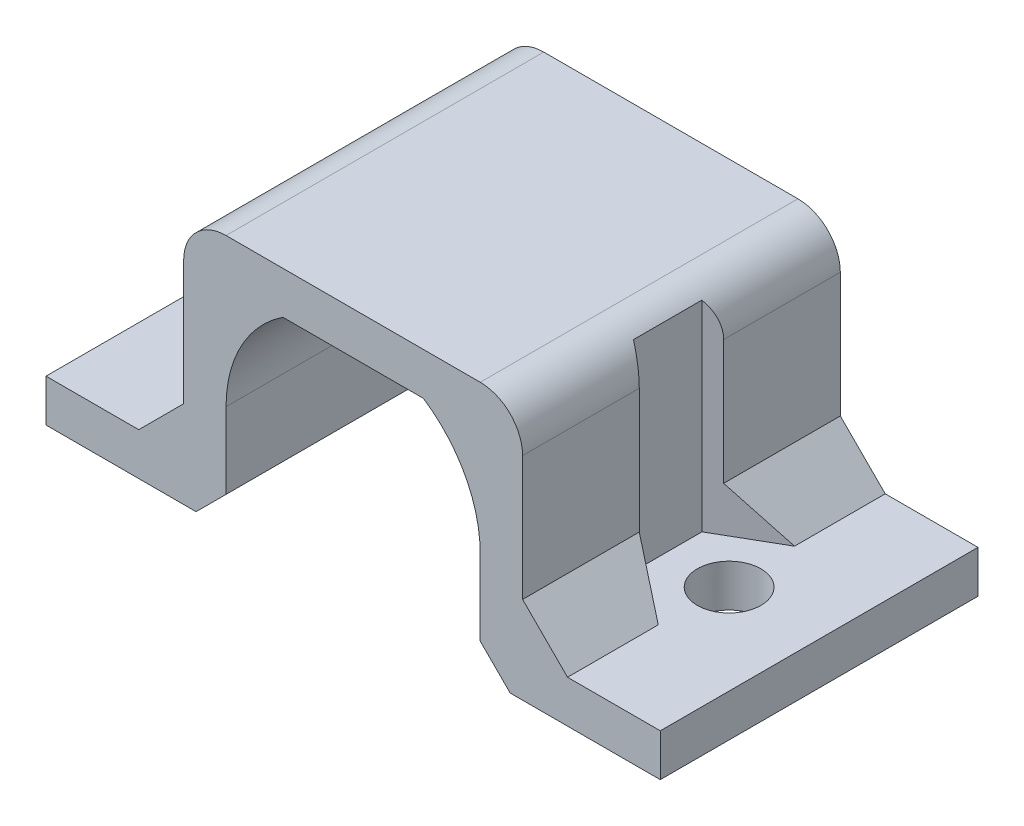
ISO-10303-21;
HEADER;
FILE_DESCRIPTION(('STEP AP214'),'2;1');
FILE_NAME('part.step','',(''),(''),'','','');
FILE_SCHEMA(('AUTOMOTIVE_DESIGN { 1 0 10303 214 1 1 1 1 }'));
ENDSEC;
DATA;
#1=APPLICATION_CONTEXT('core data for automotive mechanical design processes');
#2=APPLICATION_PROTOCOL_DEFINITION('international standard','automotive_design',2000,#1);
#3=PRODUCT_CONTEXT('',#1,'mechanical');
#4=PRODUCT('Part','Part','',(#3));
#5=PRODUCT_RELATED_PRODUCT_CATEGORY('part','',(#4));
#6=PRODUCT_DEFINITION_FORMATION('','',#4);
#7=PRODUCT_DEFINITION_CONTEXT('part definition',#1,'design');
#8=PRODUCT_DEFINITION('design','',#6,#7);
#9=PRODUCT_DEFINITION_SHAPE('','',#8);
#10=(LENGTH_UNIT() NAMED_UNIT(*) SI_UNIT(.MILLI.,.METRE.));
#11=(NAMED_UNIT(*) PLANE_ANGLE_UNIT() SI_UNIT($,.RADIAN.));
#12=(NAMED_UNIT(*) SI_UNIT($,.STERADIAN.) SOLID_ANGLE_UNIT());
#13=UNCERTAINTY_MEASURE_WITH_UNIT(LENGTH_MEASURE(1.E-05),#10,'distance_accuracy_value','');
#14=(GEOMETRIC_REPRESENTATION_CONTEXT(3) GLOBAL_UNCERTAINTY_ASSIGNED_CONTEXT((#13)) GLOBAL_UNIT_ASSIGNED_CONTEXT((#10,
#11,#12)) REPRESENTATION_CONTEXT('',''));
#15=CARTESIAN_POINT('',(0.,0.,0.));
#16=DIRECTION('',(0.,0.,1.));
#17=DIRECTION('',(1.,0.,0.));
#18=AXIS2_PLACEMENT_3D('',#15,#16,#17);
#19=CARTESIAN_POINT('',(7.99999999999999,4.12132034355965,7.5));
#20=DIRECTION('',(-0.707106781186549,-0.707106781186546,0.));
#21=DIRECTION('',(0.707106781186546,-0.707106781186549,0.));
#22=AXIS2_PLACEMENT_3D('',#19,#20,#21);
#23=PLANE('',#22);
#24=DIRECTION('',(0.,0.,-1.));
#25=VECTOR('',#24,1.);
#26=CARTESIAN_POINT('',(7.99999999999999,4.12132034355965,7.5));
#27=LINE('',#26,#25);
#28=CARTESIAN_POINT('',(7.99999999999999,4.12132034355965,-1.99185842870421));
#29=VERTEX_POINT('',#28);
#30=CARTESIAN_POINT('',(7.99999999999999,4.12132034355965,-7.5));
#31=VERTEX_POINT('',#30);
#32=EDGE_CURVE('E486',#29,#31,#27,.T.);
#33=ORIENTED_EDGE('',*,*,#32,.F.);
#34=DIRECTION('',(0.654653670707976,-0.654653670707979,-0.377964473009226));
#35=VECTOR('',#34,1.);
#36=CARTESIAN_POINT('',(5.65137413474764,6.46994620881202,-0.635878653175043));
#37=LINE('',#36,#35);
#38=CARTESIAN_POINT('',(10.1213203435596,2.00000000000005,-3.21660330009577));
#39=VERTEX_POINT('',#38);
#40=EDGE_CURVE('E277',#29,#39,#37,.T.);
#41=ORIENTED_EDGE('',*,*,#40,.T.);
#42=DIRECTION('',(0.,0.,-1.));
#43=VECTOR('',#42,1.);
#44=CARTESIAN_POINT('',(10.1213203435596,2.,7.5));
#45=LINE('',#44,#43);
#46=CARTESIAN_POINT('',(10.1213203435596,2.,-7.5));
#47=VERTEX_POINT('',#46);
#48=EDGE_CURVE('E491',#39,#47,#45,.T.);
#49=ORIENTED_EDGE('',*,*,#48,.T.);
#50=DIRECTION('',(-0.707106781186546,0.707106781186549,0.));
#51=VECTOR('',#50,1.);
#52=CARTESIAN_POINT('',(7.99999999999999,4.12132034355965,-7.5));
#53=LINE('',#52,#51);
#54=EDGE_CURVE('E381',#47,#31,#53,.T.);
#55=ORIENTED_EDGE('',*,*,#54,.T.);
#56=EDGE_LOOP('',(#33,#41,#49,#55));
#57=FACE_BOUND('',#56,.T.);
#58=ADVANCED_FACE('F39',(#57),#23,.F.);
#59=CARTESIAN_POINT('',(8.,12.,7.5));
#60=DIRECTION('',(-1.,0.,0.));
#61=DIRECTION('',(0.,-1.,0.));
#62=AXIS2_PLACEMENT_3D('',#59,#60,#61);
#63=PLANE('',#62);
#64=DIRECTION('',(0.,0.,-1.));
#65=VECTOR('',#64,1.);
#66=CARTESIAN_POINT('',(8.,10.,7.5));
#67=LINE('',#66,#65);
#68=CARTESIAN_POINT('',(8.,10.,-7.5));
#69=VERTEX_POINT('',#68);
#70=CARTESIAN_POINT('',(8.,10.,-1.99185842870421));
#71=VERTEX_POINT('',#70);
#72=EDGE_CURVE('E524',#69,#71,#67,.F.);
#73=ORIENTED_EDGE('',*,*,#72,.T.);
#74=DIRECTION('',(0.,-1.,0.));
#75=VECTOR('',#74,1.);
#76=CARTESIAN_POINT('',(8.,12.,-1.99185842870422));
#77=LINE('',#76,#75);
#78=EDGE_CURVE('E273',#71,#29,#77,.T.);
#79=ORIENTED_EDGE('',*,*,#78,.T.);
#80=ORIENTED_EDGE('',*,*,#32,.T.);
#81=DIRECTION('',(0.,1.,0.));
#82=VECTOR('',#81,1.);
#83=CARTESIAN_POINT('',(8.,12.,-7.5));
#84=LINE('',#83,#82);
#85=EDGE_CURVE('E385',#31,#69,#84,.T.);
#86=ORIENTED_EDGE('',*,*,#85,.T.);
#87=EDGE_LOOP('',(#73,#79,#80,#86));
#88=FACE_BOUND('',#87,.T.);
#89=ADVANCED_FACE('F614',(#88),#63,.F.);
#90=CARTESIAN_POINT('',(-8.,12.,7.5));
#91=DIRECTION('',(1.,0.,0.));
#92=DIRECTION('',(0.,1.,0.));
#93=AXIS2_PLACEMENT_3D('',#90,#91,#92);
#94=PLANE('',#93);
#95=DIRECTION('',(0.,0.,-1.));
#96=VECTOR('',#95,1.);
#97=CARTESIAN_POINT('',(-8.,10.,7.5));
#98=LINE('',#97,#96);
#99=CARTESIAN_POINT('',(-8.,10.,7.5));
#100=VERTEX_POINT('',#99);
#101=CARTESIAN_POINT('',(-8.,10.,1.99185842870421));
#102=VERTEX_POINT('',#101);
#103=EDGE_CURVE('E500',#100,#102,#98,.T.);
#104=ORIENTED_EDGE('',*,*,#103,.T.);
#105=DIRECTION('',(0.,-1.,0.));
#106=VECTOR('',#105,1.);
#107=CARTESIAN_POINT('',(-8.,12.,1.99185842870421));
#108=LINE('',#107,#106);
#109=CARTESIAN_POINT('',(-7.99999999999999,4.12132034355965,1.99185842870421));
#110=VERTEX_POINT('',#109);
#111=EDGE_CURVE('E306',#102,#110,#108,.T.);
#112=ORIENTED_EDGE('',*,*,#111,.T.);
#113=DIRECTION('',(0.,0.,-1.));
#114=VECTOR('',#113,1.);
#115=CARTESIAN_POINT('',(-7.99999999999999,4.12132034355965,7.5));
#116=LINE('',#115,#114);
#117=CARTESIAN_POINT('',(-7.99999999999999,4.12132034355965,7.5));
#118=VERTEX_POINT('',#117);
#119=EDGE_CURVE('E482',#118,#110,#116,.T.);
#120=ORIENTED_EDGE('',*,*,#119,.F.);
#121=DIRECTION('',(0.,-1.,0.));
#122=VECTOR('',#121,1.);
#123=CARTESIAN_POINT('',(-8.,12.,7.5));
#124=LINE('',#123,#122);
#125=EDGE_CURVE('E334',#100,#118,#124,.T.);
#126=ORIENTED_EDGE('',*,*,#125,.F.);
#127=EDGE_LOOP('',(#104,#112,#120,#126));
#128=FACE_BOUND('',#127,.T.);
#129=ADVANCED_FACE('F585',(#128),#94,.F.);
#130=CARTESIAN_POINT('',(-7.99999999999999,4.12132034355965,7.5));
#131=DIRECTION('',(0.707106781186549,-0.707106781186546,0.));
#132=DIRECTION('',(0.707106781186546,0.707106781186549,0.));
#133=AXIS2_PLACEMENT_3D('',#130,#131,#132);
#134=PLANE('',#133);
#135=ORIENTED_EDGE('',*,*,#119,.T.);
#136=DIRECTION('',(-0.654653670707976,-0.654653670707978,0.377964473009226));
#137=VECTOR('',#136,1.);
#138=CARTESIAN_POINT('',(-9.36291157953807,2.75840876402157,2.77873579603217));
#139=LINE('',#138,#137);
#140=CARTESIAN_POINT('',(-10.1213203435596,2.00000000000001,3.21660330009579));
#141=VERTEX_POINT('',#140);
#142=EDGE_CURVE('E310',#110,#141,#139,.T.);
#143=ORIENTED_EDGE('',*,*,#142,.T.);
#144=DIRECTION('',(0.,0.,-1.));
#145=VECTOR('',#144,1.);
#146=CARTESIAN_POINT('',(-10.1213203435596,2.,7.5));
#147=LINE('',#146,#145);
#148=CARTESIAN_POINT('',(-10.1213203435596,2.,7.5));
#149=VERTEX_POINT('',#148);
#150=EDGE_CURVE('E477',#149,#141,#147,.T.);
#151=ORIENTED_EDGE('',*,*,#150,.F.);
#152=DIRECTION('',(-0.707106781186546,-0.707106781186549,0.));
#153=VECTOR('',#152,1.);
#154=CARTESIAN_POINT('',(-7.99999999999999,4.12132034355965,7.5));
#155=LINE('',#154,#153);
#156=EDGE_CURVE('E337',#118,#149,#155,.T.);
#157=ORIENTED_EDGE('',*,*,#156,.F.);
#158=EDGE_LOOP('',(#135,#143,#151,#157));
#159=FACE_BOUND('',#158,.T.);
#160=ADVANCED_FACE('F578',(#159),#134,.F.);
#161=CARTESIAN_POINT('',(14.5,2.,7.5));
#162=DIRECTION('',(-1.,0.,0.));
#163=DIRECTION('',(0.,-1.,0.));
#164=AXIS2_PLACEMENT_3D('',#161,#162,#163);
#165=PLANE('',#164);
#166=DIRECTION('',(0.,1.,0.));
#167=VECTOR('',#166,1.);
#168=CARTESIAN_POINT('',(14.5,2.,-7.5));
#169=LINE('',#168,#167);
#170=CARTESIAN_POINT('',(14.5,0.,-7.5));
#171=VERTEX_POINT('',#170);
#172=CARTESIAN_POINT('',(14.5,2.,-7.5));
#173=VERTEX_POINT('',#172);
#174=EDGE_CURVE('E314',#171,#173,#169,.T.);
#175=ORIENTED_EDGE('',*,*,#174,.T.);
#176=DIRECTION('',(0.,0.,-1.));
#177=VECTOR('',#176,1.);
#178=CARTESIAN_POINT('',(14.5,2.,7.5));
#179=LINE('',#178,#177);
#180=CARTESIAN_POINT('',(14.5,2.,7.5));
#181=VERTEX_POINT('',#180);
#182=EDGE_CURVE('E495',#181,#173,#179,.T.);
#183=ORIENTED_EDGE('',*,*,#182,.F.);
#184=DIRECTION('',(0.,1.,0.));
#185=VECTOR('',#184,1.);
#186=CARTESIAN_POINT('',(14.5,2.,7.5));
#187=LINE('',#186,#185);
#188=CARTESIAN_POINT('',(14.5,0.,7.5));
#189=VERTEX_POINT('',#188);
#190=EDGE_CURVE('E315',#189,#181,#187,.T.);
#191=ORIENTED_EDGE('',*,*,#190,.F.);
#192=DIRECTION('',(0.,0.,-1.));
#193=VECTOR('',#192,1.);
#194=CARTESIAN_POINT('',(14.5,0.,7.5));
#195=LINE('',#194,#193);
#196=EDGE_CURVE('E373',#189,#171,#195,.T.);
#197=ORIENTED_EDGE('',*,*,#196,.T.);
#198=EDGE_LOOP('',(#175,#183,#191,#197));
#199=FACE_BOUND('',#198,.T.);
#200=ADVANCED_FACE('F622',(#199),#165,.F.);
#201=CARTESIAN_POINT('',(10.1213203435596,2.,7.5));
#202=DIRECTION('',(0.,-1.,0.));
#203=DIRECTION('',(1.,0.,0.));
#204=AXIS2_PLACEMENT_3D('',#201,#202,#203);
#205=PLANE('',#204);
#206=CARTESIAN_POINT('',(10.25,2.00000000000001,0.));
#207=DIRECTION('',(0.,-1.,0.));
#208=DIRECTION('',(1.,0.,0.));
#209=AXIS2_PLACEMENT_3D('',#206,#207,#208);
#210=CIRCLE('',#209,1.5);
#211=CARTESIAN_POINT('',(11.75,2.,0.));
#212=VERTEX_POINT('',#211);
#213=EDGE_CURVE('E939',#212,#212,#210,.T.);
#214=ORIENTED_EDGE('',*,*,#213,.T.);
#215=EDGE_LOOP('',(#214));
#216=FACE_BOUND('',#215,.T.);
#217=DIRECTION('',(0.866025403784439,0.,0.5));
#218=VECTOR('',#217,1.);
#219=CARTESIAN_POINT('',(10.15,2.00000000000005,3.23316150746189));
#220=LINE('',#219,#218);
#221=CARTESIAN_POINT('',(7.35,2.00000000000004,1.61658075373095));
#222=VERTEX_POINT('',#221);
#223=CARTESIAN_POINT('',(10.1213203435596,2.00000000000005,3.21660330009577));
#224=VERTEX_POINT('',#223);
#225=EDGE_CURVE('E234',#222,#224,#220,.T.);
#226=ORIENTED_EDGE('',*,*,#225,.T.);
#227=CARTESIAN_POINT('',(10.1213203435596,2.,7.5));
#228=VERTEX_POINT('',#227);
#229=EDGE_CURVE('E492',#228,#224,#45,.T.);
#230=ORIENTED_EDGE('',*,*,#229,.F.);
#231=DIRECTION('',(-1.,0.,0.));
#232=VECTOR('',#231,1.);
#233=CARTESIAN_POINT('',(10.1213203435596,2.,7.5));
#234=LINE('',#233,#232);
#235=EDGE_CURVE('E319',#181,#228,#234,.T.);
#236=ORIENTED_EDGE('',*,*,#235,.F.);
#237=ORIENTED_EDGE('',*,*,#182,.T.);
#238=DIRECTION('',(-1.,0.,0.));
#239=VECTOR('',#238,1.);
#240=CARTESIAN_POINT('',(10.1213203435596,2.,-7.5));
#241=LINE('',#240,#239);
#242=EDGE_CURVE('E377',#173,#47,#241,.T.);
#243=ORIENTED_EDGE('',*,*,#242,.T.);
#244=ORIENTED_EDGE('',*,*,#48,.F.);
#245=DIRECTION('',(-0.866025403784439,0.,0.5));
#246=VECTOR('',#245,1.);
#247=CARTESIAN_POINT('',(7.34999999999999,2.00000000000004,-1.61658075373095));
#248=LINE('',#247,#246);
#249=CARTESIAN_POINT('',(7.35,2.00000000000004,-1.61658075373096));
#250=VERTEX_POINT('',#249);
#251=EDGE_CURVE('E257',#39,#250,#248,.T.);
#252=ORIENTED_EDGE('',*,*,#251,.T.);
#253=DIRECTION('',(0.,0.,1.));
#254=VECTOR('',#253,1.);
#255=CARTESIAN_POINT('',(7.35,2.00000000000004,1.61658075373095));
#256=LINE('',#255,#254);
#257=EDGE_CURVE('E249',#250,#222,#256,.T.);
#258=ORIENTED_EDGE('',*,*,#257,.T.);
#259=EDGE_LOOP('',(#226,#230,#236,#237,#243,#244,#252,#258));
#260=FACE_BOUND('',#259,.T.);
#261=ADVANCED_FACE('F255',(#216,#260),#205,.F.);
#262=ORIENTED_EDGE('',*,*,#229,.T.);
#263=DIRECTION('',(-0.654653670707976,0.654653670707979,-0.377964473009226));
#264=VECTOR('',#263,1.);
#265=CARTESIAN_POINT('',(9.36291157953807,2.75840876402157,2.77873579603217));
#266=LINE('',#265,#264);
#267=CARTESIAN_POINT('',(7.99999999999999,4.12132034355965,1.99185842870421));
#268=VERTEX_POINT('',#267);
#269=EDGE_CURVE('E237',#224,#268,#266,.T.);
#270=ORIENTED_EDGE('',*,*,#269,.T.);
#271=CARTESIAN_POINT('',(7.99999999999999,4.12132034355965,7.5));
#272=VERTEX_POINT('',#271);
#273=EDGE_CURVE('E487',#272,#268,#27,.T.);
#274=ORIENTED_EDGE('',*,*,#273,.F.);
#275=DIRECTION('',(-0.707106781186546,0.707106781186549,0.));
#276=VECTOR('',#275,1.);
#277=CARTESIAN_POINT('',(7.99999999999999,4.12132034355965,7.5));
#278=LINE('',#277,#276);
#279=EDGE_CURVE('E323',#228,#272,#278,.T.);
#280=ORIENTED_EDGE('',*,*,#279,.F.);
#281=EDGE_LOOP('',(#262,#270,#274,#280));
#282=FACE_BOUND('',#281,.T.);
#283=ADVANCED_FACE('F670',(#282),#23,.F.);
#284=ORIENTED_EDGE('',*,*,#273,.T.);
#285=DIRECTION('',(0.,1.,0.));
#286=VECTOR('',#285,1.);
#287=CARTESIAN_POINT('',(8.,12.,1.99185842870421));
#288=LINE('',#287,#286);
#289=CARTESIAN_POINT('',(8.,10.,1.99185842870421));
#290=VERTEX_POINT('',#289);
#291=EDGE_CURVE('E243',#268,#290,#288,.T.);
#292=ORIENTED_EDGE('',*,*,#291,.T.);
#293=CARTESIAN_POINT('',(8.,10.,7.5));
#294=VERTEX_POINT('',#293);
#295=EDGE_CURVE('E523',#290,#294,#67,.F.);
#296=ORIENTED_EDGE('',*,*,#295,.T.);
#297=DIRECTION('',(0.,1.,0.));
#298=VECTOR('',#297,1.);
#299=CARTESIAN_POINT('',(8.,12.,7.5));
#300=LINE('',#299,#298);
#301=EDGE_CURVE('E326',#272,#294,#300,.T.);
#302=ORIENTED_EDGE('',*,*,#301,.F.);
#303=EDGE_LOOP('',(#284,#292,#296,#302));
#304=FACE_BOUND('',#303,.T.);
#305=ADVANCED_FACE('F675',(#304),#63,.F.);
#306=CARTESIAN_POINT('',(-8.,12.,7.5));
#307=DIRECTION('',(0.,-1.,0.));
#308=DIRECTION('',(0.,0.,-1.));
#309=AXIS2_PLACEMENT_3D('',#306,#307,#308);
#310=PLANE('',#309);
#311=DIRECTION('',(-1.,0.,0.));
#312=VECTOR('',#311,1.);
#313=CARTESIAN_POINT('',(-8.,12.,-7.5));
#314=LINE('',#313,#312);
#315=CARTESIAN_POINT('',(6.,12.,-7.5));
#316=VERTEX_POINT('',#315);
#317=CARTESIAN_POINT('',(-6.,12.,-7.5));
#318=VERTEX_POINT('',#317);
#319=EDGE_CURVE('E389',#316,#318,#314,.T.);
#320=ORIENTED_EDGE('',*,*,#319,.T.);
#321=DIRECTION('',(0.,0.,-1.));
#322=VECTOR('',#321,1.);
#323=CARTESIAN_POINT('',(-6.,12.,7.5));
#324=LINE('',#323,#322);
#325=CARTESIAN_POINT('',(-6.,12.,7.5));
#326=VERTEX_POINT('',#325);
#327=EDGE_CURVE('E514',#318,#326,#324,.F.);
#328=ORIENTED_EDGE('',*,*,#327,.T.);
#329=DIRECTION('',(-1.,0.,0.));
#330=VECTOR('',#329,1.);
#331=CARTESIAN_POINT('',(-8.,12.,7.5));
#332=LINE('',#331,#330);
#333=CARTESIAN_POINT('',(6.,12.,7.5));
#334=VERTEX_POINT('',#333);
#335=EDGE_CURVE('E330',#334,#326,#332,.T.);
#336=ORIENTED_EDGE('',*,*,#335,.F.);
#337=DIRECTION('',(0.,0.,-1.));
#338=VECTOR('',#337,1.);
#339=CARTESIAN_POINT('',(6.,12.,7.5));
#340=LINE('',#339,#338);
#341=EDGE_CURVE('E510',#334,#316,#340,.T.);
#342=ORIENTED_EDGE('',*,*,#341,.T.);
#343=EDGE_LOOP('',(#320,#328,#336,#342));
#344=FACE_BOUND('',#343,.T.);
#345=ADVANCED_FACE('F603',(#344),#310,.F.);
#346=CARTESIAN_POINT('',(-7.99999999999999,4.12132034355965,-1.99185842870421));
#347=VERTEX_POINT('',#346);
#348=CARTESIAN_POINT('',(-7.99999999999999,4.12132034355965,-7.5));
#349=VERTEX_POINT('',#348);
#350=EDGE_CURVE('E481',#347,#349,#116,.T.);
#351=ORIENTED_EDGE('',*,*,#350,.F.);
#352=DIRECTION('',(0.,1.,0.));
#353=VECTOR('',#352,1.);
#354=CARTESIAN_POINT('',(-8.,12.,-1.99185842870422));
#355=LINE('',#354,#353);
#356=CARTESIAN_POINT('',(-8.,10.,-1.99185842870421));
#357=VERTEX_POINT('',#356);
#358=EDGE_CURVE('E289',#347,#357,#355,.T.);
#359=ORIENTED_EDGE('',*,*,#358,.T.);
#360=CARTESIAN_POINT('',(-8.,10.,-7.5));
#361=VERTEX_POINT('',#360);
#362=EDGE_CURVE('E499',#357,#361,#98,.T.);
#363=ORIENTED_EDGE('',*,*,#362,.T.);
#364=DIRECTION('',(0.,-1.,0.));
#365=VECTOR('',#364,1.);
#366=CARTESIAN_POINT('',(-8.,12.,-7.5));
#367=LINE('',#366,#365);
#368=EDGE_CURVE('E393',#361,#349,#367,.T.);
#369=ORIENTED_EDGE('',*,*,#368,.T.);
#370=EDGE_LOOP('',(#351,#359,#363,#369));
#371=FACE_BOUND('',#370,.T.);
#372=ADVANCED_FACE('F600',(#371),#94,.F.);
#373=CARTESIAN_POINT('',(-10.1213203435596,2.,-3.2166033000958));
#374=VERTEX_POINT('',#373);
#375=CARTESIAN_POINT('',(-10.1213203435596,2.,-7.5));
#376=VERTEX_POINT('',#375);
#377=EDGE_CURVE('E476',#374,#376,#147,.T.);
#378=ORIENTED_EDGE('',*,*,#377,.F.);
#379=DIRECTION('',(0.654653670707976,0.654653670707978,0.377964473009227));
#380=VECTOR('',#379,1.);
#381=CARTESIAN_POINT('',(-5.65137413474763,6.46994620881202,-0.63587865317504));
#382=LINE('',#381,#380);
#383=EDGE_CURVE('E302',#374,#347,#382,.T.);
#384=ORIENTED_EDGE('',*,*,#383,.T.);
#385=ORIENTED_EDGE('',*,*,#350,.T.);
#386=DIRECTION('',(-0.707106781186546,-0.707106781186549,0.));
#387=VECTOR('',#386,1.);
#388=CARTESIAN_POINT('',(-7.99999999999999,4.12132034355965,-7.5));
#389=LINE('',#388,#387);
#390=EDGE_CURVE('E397',#349,#376,#389,.T.);
#391=ORIENTED_EDGE('',*,*,#390,.T.);
#392=EDGE_LOOP('',(#378,#384,#385,#391));
#393=FACE_BOUND('',#392,.T.);
#394=ADVANCED_FACE('F553',(#393),#134,.F.);
#395=CARTESIAN_POINT('',(-10.1213203435596,2.,7.5));
#396=DIRECTION('',(0.,-1.,0.));
#397=DIRECTION('',(1.,0.,0.));
#398=AXIS2_PLACEMENT_3D('',#395,#396,#397);
#399=PLANE('',#398);
#400=CARTESIAN_POINT('',(-10.25,2.00000000000001,0.));
#401=DIRECTION('',(0.,-1.,0.));
#402=DIRECTION('',(1.,0.,0.));
#403=AXIS2_PLACEMENT_3D('',#400,#401,#402);
#404=CIRCLE('',#403,1.5);
#405=CARTESIAN_POINT('',(-8.75,2.00000000000001,0.));
#406=VERTEX_POINT('',#405);
#407=EDGE_CURVE('E266',#406,#406,#404,.T.);
#408=ORIENTED_EDGE('',*,*,#407,.T.);
#409=EDGE_LOOP('',(#408));
#410=FACE_BOUND('',#409,.T.);
#411=ORIENTED_EDGE('',*,*,#150,.T.);
#412=DIRECTION('',(0.866025403784439,0.,-0.5));
#413=VECTOR('',#412,1.);
#414=CARTESIAN_POINT('',(-10.15,2.00000000000001,3.23316150746191));
#415=LINE('',#414,#413);
#416=CARTESIAN_POINT('',(-7.35,2.00000000000001,1.61658075373095));
#417=VERTEX_POINT('',#416);
#418=EDGE_CURVE('E281',#141,#417,#415,.T.);
#419=ORIENTED_EDGE('',*,*,#418,.T.);
#420=DIRECTION('',(0.,0.,-1.));
#421=VECTOR('',#420,1.);
#422=CARTESIAN_POINT('',(-7.35,2.00000000000001,1.61658075373095));
#423=LINE('',#422,#421);
#424=CARTESIAN_POINT('',(-7.35,2.00000000000001,-1.61658075373096));
#425=VERTEX_POINT('',#424);
#426=EDGE_CURVE('E290',#417,#425,#423,.T.);
#427=ORIENTED_EDGE('',*,*,#426,.T.);
#428=DIRECTION('',(-0.866025403784439,0.,-0.5));
#429=VECTOR('',#428,1.);
#430=CARTESIAN_POINT('',(-7.35000000000001,2.00000000000001,-1.61658075373096));
#431=LINE('',#430,#429);
#432=EDGE_CURVE('E285',#425,#374,#431,.T.);
#433=ORIENTED_EDGE('',*,*,#432,.T.);
#434=ORIENTED_EDGE('',*,*,#377,.T.);
#435=DIRECTION('',(-1.,0.,0.));
#436=VECTOR('',#435,1.);
#437=CARTESIAN_POINT('',(-10.1213203435596,2.,-7.5));
#438=LINE('',#437,#436);
#439=CARTESIAN_POINT('',(-14.5,2.,-7.5));
#440=VERTEX_POINT('',#439);
#441=EDGE_CURVE('E401',#376,#440,#438,.T.);
#442=ORIENTED_EDGE('',*,*,#441,.T.);
#443=DIRECTION('',(0.,0.,-1.));
#444=VECTOR('',#443,1.);
#445=CARTESIAN_POINT('',(-14.5,2.,7.5));
#446=LINE('',#445,#444);
#447=CARTESIAN_POINT('',(-14.5,2.,7.5));
#448=VERTEX_POINT('',#447);
#449=EDGE_CURVE('E472',#448,#440,#446,.T.);
#450=ORIENTED_EDGE('',*,*,#449,.F.);
#451=DIRECTION('',(-1.,0.,0.));
#452=VECTOR('',#451,1.);
#453=CARTESIAN_POINT('',(-10.1213203435596,2.,7.5));
#454=LINE('',#453,#452);
#455=EDGE_CURVE('E340',#149,#448,#454,.T.);
#456=ORIENTED_EDGE('',*,*,#455,.F.);
#457=EDGE_LOOP('',(#411,#419,#427,#433,#434,#442,#450,#456));
#458=FACE_BOUND('',#457,.T.);
#459=ADVANCED_FACE('F548',(#410,#458),#399,.F.);
#460=CARTESIAN_POINT('',(-14.5,2.,7.5));
#461=DIRECTION('',(1.,0.,0.));
#462=DIRECTION('',(0.,1.,0.));
#463=AXIS2_PLACEMENT_3D('',#460,#461,#462);
#464=PLANE('',#463);
#465=DIRECTION('',(0.,-1.,0.));
#466=VECTOR('',#465,1.);
#467=CARTESIAN_POINT('',(-14.5,2.,-7.5));
#468=LINE('',#467,#466);
#469=CARTESIAN_POINT('',(-14.5,0.,-7.5));
#470=VERTEX_POINT('',#469);
#471=EDGE_CURVE('E404',#440,#470,#468,.T.);
#472=ORIENTED_EDGE('',*,*,#471,.T.);
#473=DIRECTION('',(0.,0.,-1.));
#474=VECTOR('',#473,1.);
#475=CARTESIAN_POINT('',(-14.5,0.,7.5));
#476=LINE('',#475,#474);
#477=CARTESIAN_POINT('',(-14.5,0.,7.5));
#478=VERTEX_POINT('',#477);
#479=EDGE_CURVE('E468',#478,#470,#476,.T.);
#480=ORIENTED_EDGE('',*,*,#479,.F.);
#481=DIRECTION('',(0.,-1.,0.));
#482=VECTOR('',#481,1.);
#483=CARTESIAN_POINT('',(-14.5,2.,7.5));
#484=LINE('',#483,#482);
#485=EDGE_CURVE('E343',#448,#478,#484,.T.);
#486=ORIENTED_EDGE('',*,*,#485,.F.);
#487=ORIENTED_EDGE('',*,*,#449,.T.);
#488=EDGE_LOOP('',(#472,#480,#486,#487));
#489=FACE_BOUND('',#488,.T.);
#490=ADVANCED_FACE('F563',(#489),#464,.F.);
#491=CARTESIAN_POINT('',(-14.5,0.,7.5));
#492=DIRECTION('',(0.,1.,0.));
#493=DIRECTION('',(-1.,0.,0.));
#494=AXIS2_PLACEMENT_3D('',#491,#492,#493);
#495=PLANE('',#494);
#496=CARTESIAN_POINT('',(-10.25,0.,0.));
#497=DIRECTION('',(0.,-1.,0.));
#498=DIRECTION('',(1.,0.,0.));
#499=AXIS2_PLACEMENT_3D('',#496,#497,#498);
#500=CIRCLE('',#499,1.5);
#501=CARTESIAN_POINT('',(-8.75,0.,0.));
#502=VERTEX_POINT('',#501);
#503=EDGE_CURVE('E936',#502,#502,#500,.T.);
#504=ORIENTED_EDGE('',*,*,#503,.F.);
#505=EDGE_LOOP('',(#504));
#506=FACE_BOUND('',#505,.T.);
#507=DIRECTION('',(1.,0.,0.));
#508=VECTOR('',#507,1.);
#509=CARTESIAN_POINT('',(-14.5,0.,-7.5));
#510=LINE('',#509,#508);
#511=CARTESIAN_POINT('',(-7.41421356237309,0.,-7.5));
#512=VERTEX_POINT('',#511);
#513=EDGE_CURVE('E407',#470,#512,#510,.T.);
#514=ORIENTED_EDGE('',*,*,#513,.T.);
#515=DIRECTION('',(0.,0.,-1.));
#516=VECTOR('',#515,1.);
#517=CARTESIAN_POINT('',(-7.41421356237309,0.,7.5));
#518=LINE('',#517,#516);
#519=CARTESIAN_POINT('',(-7.41421356237309,0.,7.5));
#520=VERTEX_POINT('',#519);
#521=EDGE_CURVE('E464',#520,#512,#518,.T.);
#522=ORIENTED_EDGE('',*,*,#521,.F.);
#523=DIRECTION('',(1.,0.,0.));
#524=VECTOR('',#523,1.);
#525=CARTESIAN_POINT('',(-14.5,0.,7.5));
#526=LINE('',#525,#524);
#527=EDGE_CURVE('E346',#478,#520,#526,.T.);
#528=ORIENTED_EDGE('',*,*,#527,.F.);
#529=ORIENTED_EDGE('',*,*,#479,.T.);
#530=EDGE_LOOP('',(#514,#522,#528,#529));
#531=FACE_BOUND('',#530,.T.);
#532=ADVANCED_FACE('F567',(#506,#531),#495,.F.);
#533=CARTESIAN_POINT('',(-7.41421356237309,0.,7.5));
#534=DIRECTION('',(-0.707106781186548,0.707106781186547,0.));
#535=DIRECTION('',(-0.707106781186547,-0.707106781186548,0.));
#536=AXIS2_PLACEMENT_3D('',#533,#534,#535);
#537=PLANE('',#536);
#538=DIRECTION('',(0.707106781186547,0.707106781186548,0.));
#539=VECTOR('',#538,1.);
#540=CARTESIAN_POINT('',(-7.41421356237309,0.,-7.5));
#541=LINE('',#540,#539);
#542=CARTESIAN_POINT('',(-6.,1.4142135623731,-7.5));
#543=VERTEX_POINT('',#542);
#544=EDGE_CURVE('E410',#512,#543,#541,.T.);
#545=ORIENTED_EDGE('',*,*,#544,.T.);
#546=DIRECTION('',(0.,0.,-1.));
#547=VECTOR('',#546,1.);
#548=CARTESIAN_POINT('',(-6.,1.4142135623731,7.5));
#549=LINE('',#548,#547);
#550=CARTESIAN_POINT('',(-6.,1.4142135623731,7.5));
#551=VERTEX_POINT('',#550);
#552=EDGE_CURVE('E460',#551,#543,#549,.T.);
#553=ORIENTED_EDGE('',*,*,#552,.F.);
#554=DIRECTION('',(0.707106781186547,0.707106781186548,0.));
#555=VECTOR('',#554,1.);
#556=CARTESIAN_POINT('',(-7.41421356237309,0.,7.5));
#557=LINE('',#556,#555);
#558=EDGE_CURVE('E349',#520,#551,#557,.T.);
#559=ORIENTED_EDGE('',*,*,#558,.F.);
#560=ORIENTED_EDGE('',*,*,#521,.T.);
#561=EDGE_LOOP('',(#545,#553,#559,#560));
#562=FACE_BOUND('',#561,.T.);
#563=ADVANCED_FACE('F658',(#562),#537,.F.);
#564=CARTESIAN_POINT('',(-6.,1.4142135623731,7.5));
#565=DIRECTION('',(-1.,0.,0.));
#566=DIRECTION('',(0.,0.,1.));
#567=AXIS2_PLACEMENT_3D('',#564,#565,#566);
#568=PLANE('',#567);
#569=DIRECTION('',(0.,1.,0.));
#570=VECTOR('',#569,1.);
#571=CARTESIAN_POINT('',(-6.,1.4142135623731,-7.5));
#572=LINE('',#571,#570);
#573=CARTESIAN_POINT('',(-6.,5.,-7.5));
#574=VERTEX_POINT('',#573);
#575=EDGE_CURVE('E413',#543,#574,#572,.T.);
#576=ORIENTED_EDGE('',*,*,#575,.T.);
#577=DIRECTION('',(0.,0.,-1.));
#578=VECTOR('',#577,1.);
#579=CARTESIAN_POINT('',(-6.,5.,7.5));
#580=LINE('',#579,#578);
#581=CARTESIAN_POINT('',(-6.,5.,7.5));
#582=VERTEX_POINT('',#581);
#583=EDGE_CURVE('E456',#582,#574,#580,.T.);
#584=ORIENTED_EDGE('',*,*,#583,.F.);
#585=DIRECTION('',(0.,1.,0.));
#586=VECTOR('',#585,1.);
#587=CARTESIAN_POINT('',(-6.,1.4142135623731,7.5));
#588=LINE('',#587,#586);
#589=EDGE_CURVE('E352',#551,#582,#588,.T.);
#590=ORIENTED_EDGE('',*,*,#589,.F.);
#591=ORIENTED_EDGE('',*,*,#552,.T.);
#592=EDGE_LOOP('',(#576,#584,#590,#591));
#593=FACE_BOUND('',#592,.T.);
#594=ADVANCED_FACE('F656',(#593),#568,.F.);
#595=CARTESIAN_POINT('',(0.,5.,7.5));
#596=DIRECTION('',(0.,0.,-1.));
#597=DIRECTION('',(-1.,0.,0.));
#598=AXIS2_PLACEMENT_3D('',#595,#596,#597);
#599=CYLINDRICAL_SURFACE('',#598,6.);
#600=CARTESIAN_POINT('',(0.,5.,-7.5));
#601=DIRECTION('',(0.,0.,-1.));
#602=DIRECTION('',(-1.,0.,0.));
#603=AXIS2_PLACEMENT_3D('',#600,#601,#602);
#604=CIRCLE('',#603,6.);
#605=CARTESIAN_POINT('',(-3.3166247903554,10.,-7.5));
#606=VERTEX_POINT('',#605);
#607=EDGE_CURVE('E416',#574,#606,#604,.T.);
#608=ORIENTED_EDGE('',*,*,#607,.T.);
#609=DIRECTION('',(0.,0.,-1.));
#610=VECTOR('',#609,1.);
#611=CARTESIAN_POINT('',(-3.3166247903554,10.,7.5));
#612=LINE('',#611,#610);
#613=CARTESIAN_POINT('',(-3.3166247903554,10.,7.5));
#614=VERTEX_POINT('',#613);
#615=EDGE_CURVE('E452',#614,#606,#612,.T.);
#616=ORIENTED_EDGE('',*,*,#615,.F.);
#617=CARTESIAN_POINT('',(0.,5.,7.5));
#618=DIRECTION('',(0.,0.,-1.));
#619=DIRECTION('',(-1.,0.,0.));
#620=AXIS2_PLACEMENT_3D('',#617,#618,#619);
#621=CIRCLE('',#620,6.);
#622=EDGE_CURVE('E355',#582,#614,#621,.T.);
#623=ORIENTED_EDGE('',*,*,#622,.F.);
#624=ORIENTED_EDGE('',*,*,#583,.T.);
#625=EDGE_LOOP('',(#608,#616,#623,#624));
#626=FACE_BOUND('',#625,.T.);
#627=ADVANCED_FACE('F652',(#626),#599,.F.);
#628=CARTESIAN_POINT('',(3.3166247903554,10.,7.5));
#629=DIRECTION('',(0.,1.,0.));
#630=DIRECTION('',(0.,0.,1.));
#631=AXIS2_PLACEMENT_3D('',#628,#629,#630);
#632=PLANE('',#631);
#633=DIRECTION('',(1.,0.,0.));
#634=VECTOR('',#633,1.);
#635=CARTESIAN_POINT('',(3.3166247903554,10.,-7.5));
#636=LINE('',#635,#634);
#637=CARTESIAN_POINT('',(3.3166247903554,10.,-7.5));
#638=VERTEX_POINT('',#637);
#639=EDGE_CURVE('E419',#606,#638,#636,.T.);
#640=ORIENTED_EDGE('',*,*,#639,.T.);
#641=DIRECTION('',(0.,0.,-1.));
#642=VECTOR('',#641,1.);
#643=CARTESIAN_POINT('',(3.3166247903554,10.,7.5));
#644=LINE('',#643,#642);
#645=CARTESIAN_POINT('',(3.3166247903554,10.,7.5));
#646=VERTEX_POINT('',#645);
#647=EDGE_CURVE('E448',#646,#638,#644,.T.);
#648=ORIENTED_EDGE('',*,*,#647,.F.);
#649=DIRECTION('',(1.,0.,0.));
#650=VECTOR('',#649,1.);
#651=CARTESIAN_POINT('',(3.3166247903554,10.,7.5));
#652=LINE('',#651,#650);
#653=EDGE_CURVE('E358',#614,#646,#652,.T.);
#654=ORIENTED_EDGE('',*,*,#653,.F.);
#655=ORIENTED_EDGE('',*,*,#615,.T.);
#656=EDGE_LOOP('',(#640,#648,#654,#655));
#657=FACE_BOUND('',#656,.T.);
#658=ADVANCED_FACE('F647',(#657),#632,.F.);
#659=CARTESIAN_POINT('',(0.,5.,7.5));
#660=DIRECTION('',(0.,0.,-1.));
#661=DIRECTION('',(-1.,0.,0.));
#662=AXIS2_PLACEMENT_3D('',#659,#660,#661);
#663=CYLINDRICAL_SURFACE('',#662,6.);
#664=CARTESIAN_POINT('',(0.,5.,-7.5));
#665=DIRECTION('',(0.,0.,-1.));
#666=DIRECTION('',(1.,0.,0.));
#667=AXIS2_PLACEMENT_3D('',#664,#665,#666);
#668=CIRCLE('',#667,6.);
#669=CARTESIAN_POINT('',(6.,5.,-7.5));
#670=VERTEX_POINT('',#669);
#671=EDGE_CURVE('E422',#638,#670,#668,.T.);
#672=ORIENTED_EDGE('',*,*,#671,.T.);
#673=DIRECTION('',(0.,0.,-1.));
#674=VECTOR('',#673,1.);
#675=CARTESIAN_POINT('',(6.,5.,7.5));
#676=LINE('',#675,#674);
#677=CARTESIAN_POINT('',(6.,5.,7.5));
#678=VERTEX_POINT('',#677);
#679=EDGE_CURVE('E444',#678,#670,#676,.T.);
#680=ORIENTED_EDGE('',*,*,#679,.F.);
#681=CARTESIAN_POINT('',(0.,5.,7.5));
#682=DIRECTION('',(0.,0.,-1.));
#683=DIRECTION('',(1.,0.,0.));
#684=AXIS2_PLACEMENT_3D('',#681,#682,#683);
#685=CIRCLE('',#684,6.);
#686=EDGE_CURVE('E361',#646,#678,#685,.T.);
#687=ORIENTED_EDGE('',*,*,#686,.F.);
#688=ORIENTED_EDGE('',*,*,#647,.T.);
#689=EDGE_LOOP('',(#672,#680,#687,#688));
#690=FACE_BOUND('',#689,.T.);
#691=ADVANCED_FACE('F641',(#690),#663,.F.);
#692=CARTESIAN_POINT('',(6.,1.4142135623731,7.5));
#693=DIRECTION('',(1.,0.,0.));
#694=DIRECTION('',(0.,0.,-1.));
#695=AXIS2_PLACEMENT_3D('',#692,#693,#694);
#696=PLANE('',#695);
#697=DIRECTION('',(0.,-1.,0.));
#698=VECTOR('',#697,1.);
#699=CARTESIAN_POINT('',(6.,1.4142135623731,-7.5));
#700=LINE('',#699,#698);
#701=CARTESIAN_POINT('',(6.,1.4142135623731,-7.5));
#702=VERTEX_POINT('',#701);
#703=EDGE_CURVE('E425',#670,#702,#700,.T.);
#704=ORIENTED_EDGE('',*,*,#703,.T.);
#705=DIRECTION('',(0.,0.,-1.));
#706=VECTOR('',#705,1.);
#707=CARTESIAN_POINT('',(6.,1.4142135623731,7.5));
#708=LINE('',#707,#706);
#709=CARTESIAN_POINT('',(6.,1.4142135623731,7.5));
#710=VERTEX_POINT('',#709);
#711=EDGE_CURVE('E440',#710,#702,#708,.T.);
#712=ORIENTED_EDGE('',*,*,#711,.F.);
#713=DIRECTION('',(0.,-1.,0.));
#714=VECTOR('',#713,1.);
#715=CARTESIAN_POINT('',(6.,1.4142135623731,7.5));
#716=LINE('',#715,#714);
#717=EDGE_CURVE('E364',#678,#710,#716,.T.);
#718=ORIENTED_EDGE('',*,*,#717,.F.);
#719=ORIENTED_EDGE('',*,*,#679,.T.);
#720=EDGE_LOOP('',(#704,#712,#718,#719));
#721=FACE_BOUND('',#720,.T.);
#722=ADVANCED_FACE('F637',(#721),#696,.F.);
#723=CARTESIAN_POINT('',(7.41421356237309,0.,7.5));
#724=DIRECTION('',(0.707106781186548,0.707106781186547,0.));
#725=DIRECTION('',(-0.707106781186547,0.707106781186548,0.));
#726=AXIS2_PLACEMENT_3D('',#723,#724,#725);
#727=PLANE('',#726);
#728=DIRECTION('',(0.707106781186547,-0.707106781186548,0.));
#729=VECTOR('',#728,1.);
#730=CARTESIAN_POINT('',(7.41421356237309,0.,-7.5));
#731=LINE('',#730,#729);
#732=CARTESIAN_POINT('',(7.41421356237309,0.,-7.5));
#733=VERTEX_POINT('',#732);
#734=EDGE_CURVE('E428',#702,#733,#731,.T.);
#735=ORIENTED_EDGE('',*,*,#734,.T.);
#736=DIRECTION('',(0.,0.,-1.));
#737=VECTOR('',#736,1.);
#738=CARTESIAN_POINT('',(7.41421356237309,0.,7.5));
#739=LINE('',#738,#737);
#740=CARTESIAN_POINT('',(7.41421356237309,0.,7.5));
#741=VERTEX_POINT('',#740);
#742=EDGE_CURVE('E436',#741,#733,#739,.T.);
#743=ORIENTED_EDGE('',*,*,#742,.F.);
#744=DIRECTION('',(0.707106781186547,-0.707106781186548,0.));
#745=VECTOR('',#744,1.);
#746=CARTESIAN_POINT('',(7.41421356237309,0.,7.5));
#747=LINE('',#746,#745);
#748=EDGE_CURVE('E367',#710,#741,#747,.T.);
#749=ORIENTED_EDGE('',*,*,#748,.F.);
#750=ORIENTED_EDGE('',*,*,#711,.T.);
#751=EDGE_LOOP('',(#735,#743,#749,#750));
#752=FACE_BOUND('',#751,.T.);
#753=ADVANCED_FACE('F632',(#752),#727,.F.);
#754=CARTESIAN_POINT('',(14.5,0.,7.5));
#755=DIRECTION('',(0.,1.,0.));
#756=DIRECTION('',(-1.,0.,0.));
#757=AXIS2_PLACEMENT_3D('',#754,#755,#756);
#758=PLANE('',#757);
#759=CARTESIAN_POINT('',(10.25,0.,0.));
#760=DIRECTION('',(0.,-1.,0.));
#761=DIRECTION('',(-1.,0.,0.));
#762=AXIS2_PLACEMENT_3D('',#759,#760,#761);
#763=CIRCLE('',#762,1.5);
#764=CARTESIAN_POINT('',(8.75,0.,0.));
#765=VERTEX_POINT('',#764);
#766=EDGE_CURVE('E945',#765,#765,#763,.T.);
#767=ORIENTED_EDGE('',*,*,#766,.F.);
#768=EDGE_LOOP('',(#767));
#769=FACE_BOUND('',#768,.T.);
#770=DIRECTION('',(1.,0.,0.));
#771=VECTOR('',#770,1.);
#772=CARTESIAN_POINT('',(14.5,0.,-7.5));
#773=LINE('',#772,#771);
#774=EDGE_CURVE('E320',#733,#171,#773,.T.);
#775=ORIENTED_EDGE('',*,*,#774,.T.);
#776=ORIENTED_EDGE('',*,*,#196,.F.);
#777=DIRECTION('',(1.,0.,0.));
#778=VECTOR('',#777,1.);
#779=CARTESIAN_POINT('',(14.5,0.,7.5));
#780=LINE('',#779,#778);
#781=EDGE_CURVE('E370',#741,#189,#780,.T.);
#782=ORIENTED_EDGE('',*,*,#781,.F.);
#783=ORIENTED_EDGE('',*,*,#742,.T.);
#784=EDGE_LOOP('',(#775,#776,#782,#783));
#785=FACE_BOUND('',#784,.T.);
#786=ADVANCED_FACE('F626',(#769,#785),#758,.F.);
#787=CARTESIAN_POINT('',(0.,5.,7.5));
#788=DIRECTION('',(0.,0.,1.));
#789=DIRECTION('',(1.,0.,0.));
#790=AXIS2_PLACEMENT_3D('',#787,#788,#789);
#791=PLANE('',#790);
#792=ORIENTED_EDGE('',*,*,#335,.T.);
#793=CARTESIAN_POINT('',(-6.,10.,7.5));
#794=DIRECTION('',(0.,0.,1.));
#795=DIRECTION('',(1.,0.,0.));
#796=AXIS2_PLACEMENT_3D('',#793,#794,#795);
#797=CIRCLE('',#796,2.);
#798=EDGE_CURVE('E520',#326,#100,#797,.T.);
#799=ORIENTED_EDGE('',*,*,#798,.T.);
#800=ORIENTED_EDGE('',*,*,#125,.T.);
#801=ORIENTED_EDGE('',*,*,#156,.T.);
#802=ORIENTED_EDGE('',*,*,#455,.T.);
#803=ORIENTED_EDGE('',*,*,#485,.T.);
#804=ORIENTED_EDGE('',*,*,#527,.T.);
#805=ORIENTED_EDGE('',*,*,#558,.T.);
#806=ORIENTED_EDGE('',*,*,#589,.T.);
#807=ORIENTED_EDGE('',*,*,#622,.T.);
#808=ORIENTED_EDGE('',*,*,#653,.T.);
#809=ORIENTED_EDGE('',*,*,#686,.T.);
#810=ORIENTED_EDGE('',*,*,#717,.T.);
#811=ORIENTED_EDGE('',*,*,#748,.T.);
#812=ORIENTED_EDGE('',*,*,#781,.T.);
#813=ORIENTED_EDGE('',*,*,#190,.T.);
#814=ORIENTED_EDGE('',*,*,#235,.T.);
#815=ORIENTED_EDGE('',*,*,#279,.T.);
#816=ORIENTED_EDGE('',*,*,#301,.T.);
#817=CARTESIAN_POINT('',(6.,10.,7.5));
#818=DIRECTION('',(0.,0.,1.));
#819=DIRECTION('',(1.,0.,0.));
#820=AXIS2_PLACEMENT_3D('',#817,#818,#819);
#821=CIRCLE('',#820,2.);
#822=EDGE_CURVE('E517',#294,#334,#821,.T.);
#823=ORIENTED_EDGE('',*,*,#822,.T.);
#824=EDGE_LOOP('',(#792,#799,#800,#801,#802,#803,#804,#805,#806,#807,#808,#809,#810,#811,#812,
#813,#814,#815,#816,#823));
#825=FACE_BOUND('',#824,.T.);
#826=ADVANCED_FACE('F571',(#825),#791,.T.);
#827=CARTESIAN_POINT('',(0.,5.,-7.5));
#828=DIRECTION('',(0.,0.,1.));
#829=DIRECTION('',(1.,0.,0.));
#830=AXIS2_PLACEMENT_3D('',#827,#828,#829);
#831=PLANE('',#830);
#832=ORIENTED_EDGE('',*,*,#368,.F.);
#833=CARTESIAN_POINT('',(-6.,10.,-7.5));
#834=DIRECTION('',(0.,0.,1.));
#835=DIRECTION('',(1.,0.,0.));
#836=AXIS2_PLACEMENT_3D('',#833,#834,#835);
#837=CIRCLE('',#836,2.);
#838=EDGE_CURVE('E507',#361,#318,#837,.F.);
#839=ORIENTED_EDGE('',*,*,#838,.T.);
#840=ORIENTED_EDGE('',*,*,#319,.F.);
#841=CARTESIAN_POINT('',(6.,10.,-7.5));
#842=DIRECTION('',(0.,0.,1.));
#843=DIRECTION('',(1.,0.,0.));
#844=AXIS2_PLACEMENT_3D('',#841,#842,#843);
#845=CIRCLE('',#844,2.);
#846=EDGE_CURVE('E504',#316,#69,#845,.F.);
#847=ORIENTED_EDGE('',*,*,#846,.T.);
#848=ORIENTED_EDGE('',*,*,#85,.F.);
#849=ORIENTED_EDGE('',*,*,#54,.F.);
#850=ORIENTED_EDGE('',*,*,#242,.F.);
#851=ORIENTED_EDGE('',*,*,#174,.F.);
#852=ORIENTED_EDGE('',*,*,#774,.F.);
#853=ORIENTED_EDGE('',*,*,#734,.F.);
#854=ORIENTED_EDGE('',*,*,#703,.F.);
#855=ORIENTED_EDGE('',*,*,#671,.F.);
#856=ORIENTED_EDGE('',*,*,#639,.F.);
#857=ORIENTED_EDGE('',*,*,#607,.F.);
#858=ORIENTED_EDGE('',*,*,#575,.F.);
#859=ORIENTED_EDGE('',*,*,#544,.F.);
#860=ORIENTED_EDGE('',*,*,#513,.F.);
#861=ORIENTED_EDGE('',*,*,#471,.F.);
#862=ORIENTED_EDGE('',*,*,#441,.F.);
#863=ORIENTED_EDGE('',*,*,#390,.F.);
#864=EDGE_LOOP('',(#832,#839,#840,#847,#848,#849,#850,#851,#852,#853,#854,#855,#856,#857,#858,
#859,#860,#861,#862,#863));
#865=FACE_BOUND('',#864,.T.);
#866=ADVANCED_FACE('F558',(#865),#831,.F.);
#867=CARTESIAN_POINT('',(-6.,10.,7.5));
#868=DIRECTION('',(0.,0.,-1.));
#869=DIRECTION('',(-1.,0.,0.));
#870=AXIS2_PLACEMENT_3D('',#867,#868,#869);
#871=CYLINDRICAL_SURFACE('',#870,2.);
#872=CARTESIAN_POINT('',(-6.,10.,0.837157890324956));
#873=DIRECTION('',(0.5,0.,0.866025403784439));
#874=DIRECTION('',(0.866025403784439,0.,-0.5));
#875=AXIS2_PLACEMENT_3D('',#872,#873,#874);
#876=ELLIPSE('',#875,2.3094010767585,2.);
#877=CARTESIAN_POINT('',(-7.35,11.4756354563374,1.61658075373095));
#878=VERTEX_POINT('',#877);
#879=EDGE_CURVE('E534',#102,#878,#876,.F.);
#880=ORIENTED_EDGE('',*,*,#879,.F.);
#881=ORIENTED_EDGE('',*,*,#103,.F.);
#882=ORIENTED_EDGE('',*,*,#798,.F.);
#883=ORIENTED_EDGE('',*,*,#327,.F.);
#884=ORIENTED_EDGE('',*,*,#838,.F.);
#885=ORIENTED_EDGE('',*,*,#362,.F.);
#886=CARTESIAN_POINT('',(-6.,10.,-0.837157890324961));
#887=DIRECTION('',(0.5,0.,-0.866025403784439));
#888=DIRECTION('',(-0.866025403784439,0.,-0.5));
#889=AXIS2_PLACEMENT_3D('',#886,#887,#888);
#890=ELLIPSE('',#889,2.3094010767585,2.);
#891=CARTESIAN_POINT('',(-7.35,11.4756354563374,-1.61658075373096));
#892=VERTEX_POINT('',#891);
#893=EDGE_CURVE('E528',#892,#357,#890,.F.);
#894=ORIENTED_EDGE('',*,*,#893,.F.);
#895=DIRECTION('',(0.,0.,-1.));
#896=VECTOR('',#895,1.);
#897=CARTESIAN_POINT('',(-7.35,11.4756354563374,7.5));
#898=LINE('',#897,#896);
#899=EDGE_CURVE('E531',#878,#892,#898,.T.);
#900=ORIENTED_EDGE('',*,*,#899,.F.);
#901=EDGE_LOOP('',(#880,#881,#882,#883,#884,#885,#894,#900));
#902=FACE_BOUND('',#901,.T.);
#903=ADVANCED_FACE('F590',(#902),#871,.T.);
#904=CARTESIAN_POINT('',(6.,10.,7.5));
#905=DIRECTION('',(0.,0.,-1.));
#906=DIRECTION('',(-1.,0.,0.));
#907=AXIS2_PLACEMENT_3D('',#904,#905,#906);
#908=CYLINDRICAL_SURFACE('',#907,2.);
#909=CARTESIAN_POINT('',(6.,10.,-0.837157890324961));
#910=DIRECTION('',(-0.5,0.,-0.866025403784439));
#911=DIRECTION('',(0.866025403784439,0.,-0.5));
#912=AXIS2_PLACEMENT_3D('',#909,#910,#911);
#913=ELLIPSE('',#912,2.3094010767585,2.);
#914=CARTESIAN_POINT('',(7.35,11.4756354563374,-1.61658075373096));
#915=VERTEX_POINT('',#914);
#916=EDGE_CURVE('E11',#71,#915,#913,.F.);
#917=ORIENTED_EDGE('',*,*,#916,.F.);
#918=ORIENTED_EDGE('',*,*,#72,.F.);
#919=ORIENTED_EDGE('',*,*,#846,.F.);
#920=ORIENTED_EDGE('',*,*,#341,.F.);
#921=ORIENTED_EDGE('',*,*,#822,.F.);
#922=ORIENTED_EDGE('',*,*,#295,.F.);
#923=CARTESIAN_POINT('',(6.,10.,0.837157890324956));
#924=DIRECTION('',(-0.5,0.,0.866025403784439));
#925=DIRECTION('',(-0.866025403784439,0.,-0.5));
#926=AXIS2_PLACEMENT_3D('',#923,#924,#925);
#927=ELLIPSE('',#926,2.3094010767585,2.);
#928=CARTESIAN_POINT('',(7.35,11.4756354563374,1.61658075373095));
#929=VERTEX_POINT('',#928);
#930=EDGE_CURVE('E537',#929,#290,#927,.F.);
#931=ORIENTED_EDGE('',*,*,#930,.F.);
#932=DIRECTION('',(0.,0.,-1.));
#933=VECTOR('',#932,1.);
#934=CARTESIAN_POINT('',(7.35,11.4756354563374,7.5));
#935=LINE('',#934,#933);
#936=EDGE_CURVE('E48',#915,#929,#935,.F.);
#937=ORIENTED_EDGE('',*,*,#936,.F.);
#938=EDGE_LOOP('',(#917,#918,#919,#920,#921,#922,#931,#937));
#939=FACE_BOUND('',#938,.T.);
#940=ADVANCED_FACE('F41',(#939),#908,.T.);
#941=CARTESIAN_POINT('',(-10.15,-6.5541412972509,3.2331615074619));
#942=DIRECTION('',(0.5,0.,0.866025403784439));
#943=DIRECTION('',(0.866025403784439,0.,-0.5));
#944=AXIS2_PLACEMENT_3D('',#941,#942,#943);
#945=PLANE('',#944);
#946=ORIENTED_EDGE('',*,*,#111,.F.);
#947=ORIENTED_EDGE('',*,*,#879,.T.);
#948=DIRECTION('',(0.,1.,0.));
#949=VECTOR('',#948,1.);
#950=CARTESIAN_POINT('',(-7.35,-6.5541412972509,1.61658075373095));
#951=LINE('',#950,#949);
#952=EDGE_CURVE('E284',#417,#878,#951,.T.);
#953=ORIENTED_EDGE('',*,*,#952,.F.);
#954=ORIENTED_EDGE('',*,*,#418,.F.);
#955=ORIENTED_EDGE('',*,*,#142,.F.);
#956=EDGE_LOOP('',(#946,#947,#953,#954,#955));
#957=FACE_BOUND('',#956,.T.);
#958=ADVANCED_FACE('F581',(#957),#945,.F.);
#959=CARTESIAN_POINT('',(-7.35,-6.5541412972509,-1.61658075373096));
#960=DIRECTION('',(0.5,0.,-0.866025403784439));
#961=DIRECTION('',(-0.866025403784439,0.,-0.5));
#962=AXIS2_PLACEMENT_3D('',#959,#960,#961);
#963=PLANE('',#962);
#964=ORIENTED_EDGE('',*,*,#432,.F.);
#965=DIRECTION('',(0.,1.,0.));
#966=VECTOR('',#965,1.);
#967=CARTESIAN_POINT('',(-7.35,-6.5541412972509,-1.61658075373096));
#968=LINE('',#967,#966);
#969=EDGE_CURVE('E63',#425,#892,#968,.T.);
#970=ORIENTED_EDGE('',*,*,#969,.T.);
#971=ORIENTED_EDGE('',*,*,#893,.T.);
#972=ORIENTED_EDGE('',*,*,#358,.F.);
#973=ORIENTED_EDGE('',*,*,#383,.F.);
#974=EDGE_LOOP('',(#964,#970,#971,#972,#973));
#975=FACE_BOUND('',#974,.T.);
#976=ADVANCED_FACE('F598',(#975),#963,.F.);
#977=CARTESIAN_POINT('',(-7.35,-6.5541412972509,1.61658075373095));
#978=DIRECTION('',(1.,0.,0.));
#979=DIRECTION('',(0.,0.,-1.));
#980=AXIS2_PLACEMENT_3D('',#977,#978,#979);
#981=PLANE('',#980);
#982=ORIENTED_EDGE('',*,*,#899,.T.);
#983=ORIENTED_EDGE('',*,*,#969,.F.);
#984=ORIENTED_EDGE('',*,*,#426,.F.);
#985=ORIENTED_EDGE('',*,*,#952,.T.);
#986=EDGE_LOOP('',(#982,#983,#984,#985));
#987=FACE_BOUND('',#986,.T.);
#988=ADVANCED_FACE('F595',(#987),#981,.F.);
#989=CARTESIAN_POINT('',(7.35,-6.5541412972509,-1.61658075373096));
#990=DIRECTION('',(-0.5,0.,-0.866025403784439));
#991=DIRECTION('',(-0.866025403784439,0.,0.5));
#992=AXIS2_PLACEMENT_3D('',#989,#990,#991);
#993=PLANE('',#992);
#994=ORIENTED_EDGE('',*,*,#78,.F.);
#995=ORIENTED_EDGE('',*,*,#916,.T.);
#996=DIRECTION('',(0.,1.,0.));
#997=VECTOR('',#996,1.);
#998=CARTESIAN_POINT('',(7.35,-6.5541412972509,-1.61658075373096));
#999=LINE('',#998,#997);
#1000=EDGE_CURVE('E259',#250,#915,#999,.T.);
#1001=ORIENTED_EDGE('',*,*,#1000,.F.);
#1002=ORIENTED_EDGE('',*,*,#251,.F.);
#1003=ORIENTED_EDGE('',*,*,#40,.F.);
#1004=EDGE_LOOP('',(#994,#995,#1001,#1002,#1003));
#1005=FACE_BOUND('',#1004,.T.);
#1006=ADVANCED_FACE('F689',(#1005),#993,.F.);
#1007=CARTESIAN_POINT('',(10.15,-6.5541412972509,3.2331615074619));
#1008=DIRECTION('',(-0.5,0.,0.866025403784439));
#1009=DIRECTION('',(0.866025403784439,0.,0.5));
#1010=AXIS2_PLACEMENT_3D('',#1007,#1008,#1009);
#1011=PLANE('',#1010);
#1012=ORIENTED_EDGE('',*,*,#225,.F.);
#1013=DIRECTION('',(0.,1.,0.));
#1014=VECTOR('',#1013,1.);
#1015=CARTESIAN_POINT('',(7.35,-6.5541412972509,1.61658075373095));
#1016=LINE('',#1015,#1014);
#1017=EDGE_CURVE('E55',#222,#929,#1016,.T.);
#1018=ORIENTED_EDGE('',*,*,#1017,.T.);
#1019=ORIENTED_EDGE('',*,*,#930,.T.);
#1020=ORIENTED_EDGE('',*,*,#291,.F.);
#1021=ORIENTED_EDGE('',*,*,#269,.F.);
#1022=EDGE_LOOP('',(#1012,#1018,#1019,#1020,#1021));
#1023=FACE_BOUND('',#1022,.T.);
#1024=ADVANCED_FACE('F235',(#1023),#1011,.F.);
#1025=CARTESIAN_POINT('',(7.35,-6.5541412972509,1.61658075373095));
#1026=DIRECTION('',(-1.,0.,0.));
#1027=DIRECTION('',(0.,0.,1.));
#1028=AXIS2_PLACEMENT_3D('',#1025,#1026,#1027);
#1029=PLANE('',#1028);
#1030=ORIENTED_EDGE('',*,*,#936,.T.);
#1031=ORIENTED_EDGE('',*,*,#1017,.F.);
#1032=ORIENTED_EDGE('',*,*,#257,.F.);
#1033=ORIENTED_EDGE('',*,*,#1000,.T.);
#1034=EDGE_LOOP('',(#1030,#1031,#1032,#1033));
#1035=FACE_BOUND('',#1034,.T.);
#1036=ADVANCED_FACE('F247',(#1035),#1029,.F.);
#1037=CARTESIAN_POINT('',(-10.25,11.,0.));
#1038=DIRECTION('',(0.,-1.,0.));
#1039=DIRECTION('',(1.,0.,0.));
#1040=AXIS2_PLACEMENT_3D('',#1037,#1038,#1039);
#1041=CYLINDRICAL_SURFACE('',#1040,1.5);
#1042=ORIENTED_EDGE('',*,*,#503,.T.);
#1043=EDGE_LOOP('',(#1042));
#1044=FACE_BOUND('',#1043,.T.);
#1045=ORIENTED_EDGE('',*,*,#407,.F.);
#1046=EDGE_LOOP('',(#1045));
#1047=FACE_BOUND('',#1046,.T.);
#1048=ADVANCED_FACE('F797',(#1044,#1047),#1041,.F.);
#1049=CARTESIAN_POINT('',(10.25,11.,0.));
#1050=DIRECTION('',(0.,-1.,0.));
#1051=DIRECTION('',(1.,0.,0.));
#1052=AXIS2_PLACEMENT_3D('',#1049,#1050,#1051);
#1053=CYLINDRICAL_SURFACE('',#1052,1.5);
#1054=ORIENTED_EDGE('',*,*,#766,.T.);
#1055=EDGE_LOOP('',(#1054));
#1056=FACE_BOUND('',#1055,.T.);
#1057=ORIENTED_EDGE('',*,*,#213,.F.);
#1058=EDGE_LOOP('',(#1057));
#1059=FACE_BOUND('',#1058,.T.);
#1060=ADVANCED_FACE('F950',(#1056,#1059),#1053,.F.);
#1061=CLOSED_SHELL('',(#58,#89,#129,#160,#200,#261,#283,#305,#345,#372,#394,#459,#490,#532,#563,
#594,#627,#658,#691,#722,#753,#786,#826,#866,#903,#940,#958,#976,#988,#1006,#1024,#1036,#1048,#1060));
#1062=MANIFOLD_SOLID_BREP('B2',#1061);
#1063=ADVANCED_BREP_SHAPE_REPRESENTATION('',(#18,#1062),#14);
#1064=SHAPE_DEFINITION_REPRESENTATION(#9,#1063);
ENDSEC;
END-ISO-10303-21;
